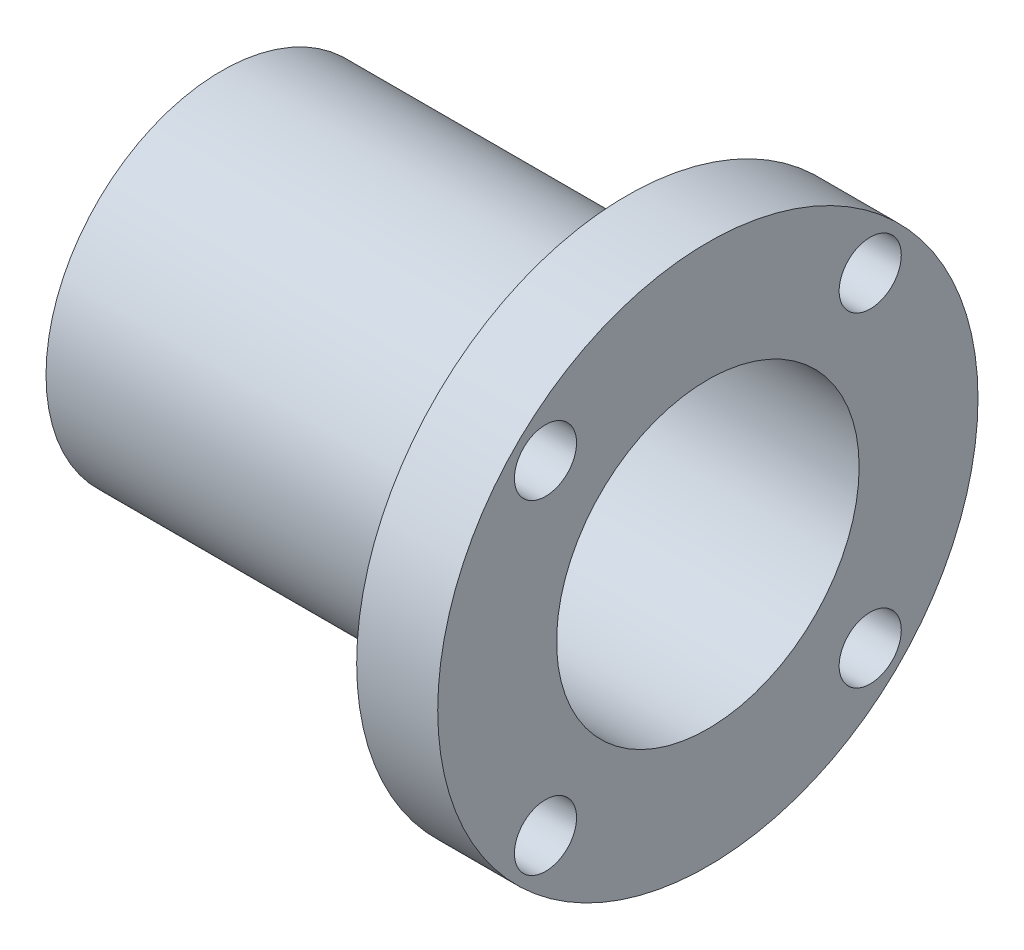
ISO-10303-21;
HEADER;
FILE_DESCRIPTION(('STEP AP214'),'2;1');
FILE_NAME('part.step','',(''),(''),'','','');
FILE_SCHEMA(('AUTOMOTIVE_DESIGN { 1 0 10303 214 1 1 1 1 }'));
ENDSEC;
DATA;
#1=APPLICATION_CONTEXT('core data for automotive mechanical design processes');
#2=APPLICATION_PROTOCOL_DEFINITION('international standard','automotive_design',2000,#1);
#3=PRODUCT_CONTEXT('',#1,'mechanical');
#4=PRODUCT('Part','Part','',(#3));
#5=PRODUCT_RELATED_PRODUCT_CATEGORY('part','',(#4));
#6=PRODUCT_DEFINITION_FORMATION('','',#4);
#7=PRODUCT_DEFINITION_CONTEXT('part definition',#1,'design');
#8=PRODUCT_DEFINITION('design','',#6,#7);
#9=PRODUCT_DEFINITION_SHAPE('','',#8);
#10=(LENGTH_UNIT() NAMED_UNIT(*) SI_UNIT(.MILLI.,.METRE.));
#11=(NAMED_UNIT(*) PLANE_ANGLE_UNIT() SI_UNIT($,.RADIAN.));
#12=(NAMED_UNIT(*) SI_UNIT($,.STERADIAN.) SOLID_ANGLE_UNIT());
#13=UNCERTAINTY_MEASURE_WITH_UNIT(LENGTH_MEASURE(1.E-05),#10,'distance_accuracy_value','');
#14=(GEOMETRIC_REPRESENTATION_CONTEXT(3) GLOBAL_UNCERTAINTY_ASSIGNED_CONTEXT((#13)) GLOBAL_UNIT_ASSIGNED_CONTEXT((#10,
#11,#12)) REPRESENTATION_CONTEXT('',''));
#15=CARTESIAN_POINT('',(0.,0.,0.));
#16=DIRECTION('',(0.,0.,1.));
#17=DIRECTION('',(1.,0.,0.));
#18=AXIS2_PLACEMENT_3D('',#15,#16,#17);
#19=CARTESIAN_POINT('',(3.,0.,0.));
#20=DIRECTION('',(-1.,0.,0.));
#21=DIRECTION('',(0.,0.,1.));
#22=AXIS2_PLACEMENT_3D('',#19,#20,#21);
#23=CYLINDRICAL_SURFACE('',#22,10.);
#24=CARTESIAN_POINT('',(3.,0.,0.));
#25=DIRECTION('',(1.,0.,0.));
#26=DIRECTION('',(0.,0.,-1.));
#27=AXIS2_PLACEMENT_3D('',#24,#25,#26);
#28=CIRCLE('',#27,10.);
#29=CARTESIAN_POINT('',(3.,0.,-10.));
#30=VERTEX_POINT('',#29);
#31=EDGE_CURVE('E10',#30,#30,#28,.T.);
#32=ORIENTED_EDGE('',*,*,#31,.F.);
#33=EDGE_LOOP('',(#32));
#34=FACE_BOUND('',#33,.T.);
#35=CARTESIAN_POINT('',(0.,0.,0.));
#36=DIRECTION('',(1.,0.,0.));
#37=DIRECTION('',(0.,0.,-1.));
#38=AXIS2_PLACEMENT_3D('',#35,#36,#37);
#39=CIRCLE('',#38,10.);
#40=CARTESIAN_POINT('',(0.,0.,-10.));
#41=VERTEX_POINT('',#40);
#42=EDGE_CURVE('E51',#41,#41,#39,.T.);
#43=ORIENTED_EDGE('',*,*,#42,.T.);
#44=EDGE_LOOP('',(#43));
#45=FACE_BOUND('',#44,.T.);
#46=ADVANCED_FACE('F43',(#34,#45),#23,.T.);
#47=CARTESIAN_POINT('',(3.,0.,0.));
#48=DIRECTION('',(1.,0.,0.));
#49=DIRECTION('',(0.,0.,-1.));
#50=AXIS2_PLACEMENT_3D('',#47,#48,#49);
#51=PLANE('',#50);
#52=CARTESIAN_POINT('',(3.,6.01040764008529,6.01040764008567));
#53=DIRECTION('',(1.,0.,0.));
#54=DIRECTION('',(0.,0.,-1.));
#55=AXIS2_PLACEMENT_3D('',#52,#53,#54);
#56=CIRCLE('',#55,1.15);
#57=CARTESIAN_POINT('',(3.,6.01040764008529,4.86040764008567));
#58=VERTEX_POINT('',#57);
#59=EDGE_CURVE('E87',#58,#58,#56,.T.);
#60=ORIENTED_EDGE('',*,*,#59,.F.);
#61=EDGE_LOOP('',(#60));
#62=FACE_BOUND('',#61,.T.);
#63=CARTESIAN_POINT('',(3.,-6.01040764008602,6.01040764008529));
#64=DIRECTION('',(1.,0.,0.));
#65=DIRECTION('',(0.,0.,-1.));
#66=AXIS2_PLACEMENT_3D('',#63,#64,#65);
#67=CIRCLE('',#66,1.15);
#68=CARTESIAN_POINT('',(3.,-6.01040764008602,4.8604076400853));
#69=VERTEX_POINT('',#68);
#70=EDGE_CURVE('E95',#69,#69,#67,.T.);
#71=ORIENTED_EDGE('',*,*,#70,.F.);
#72=EDGE_LOOP('',(#71));
#73=FACE_BOUND('',#72,.T.);
#74=CARTESIAN_POINT('',(3.,-6.01040764008564,-6.01040764008601));
#75=DIRECTION('',(1.,0.,0.));
#76=DIRECTION('',(0.,0.,-1.));
#77=AXIS2_PLACEMENT_3D('',#74,#75,#76);
#78=CIRCLE('',#77,1.15);
#79=CARTESIAN_POINT('',(3.,-6.01040764008564,-7.16040764008601));
#80=VERTEX_POINT('',#79);
#81=EDGE_CURVE('E103',#80,#80,#78,.T.);
#82=ORIENTED_EDGE('',*,*,#81,.F.);
#83=EDGE_LOOP('',(#82));
#84=FACE_BOUND('',#83,.T.);
#85=CARTESIAN_POINT('',(3.,6.01040764008567,-6.01040764008564));
#86=DIRECTION('',(1.,0.,0.));
#87=DIRECTION('',(0.,0.,-1.));
#88=AXIS2_PLACEMENT_3D('',#85,#86,#87);
#89=CIRCLE('',#88,1.15);
#90=CARTESIAN_POINT('',(3.,6.01040764008567,-7.16040764008564));
#91=VERTEX_POINT('',#90);
#92=EDGE_CURVE('E78',#91,#91,#89,.T.);
#93=ORIENTED_EDGE('',*,*,#92,.F.);
#94=EDGE_LOOP('',(#93));
#95=FACE_BOUND('',#94,.T.);
#96=CARTESIAN_POINT('',(3.,0.,0.));
#97=DIRECTION('',(1.,0.,0.));
#98=DIRECTION('',(0.,0.,-1.));
#99=AXIS2_PLACEMENT_3D('',#96,#97,#98);
#100=CIRCLE('',#99,5.6);
#101=CARTESIAN_POINT('',(3.,0.,-5.6));
#102=VERTEX_POINT('',#101);
#103=EDGE_CURVE('E71',#102,#102,#100,.T.);
#104=ORIENTED_EDGE('',*,*,#103,.F.);
#105=EDGE_LOOP('',(#104));
#106=FACE_BOUND('',#105,.T.);
#107=ORIENTED_EDGE('',*,*,#31,.T.);
#108=EDGE_LOOP('',(#107));
#109=FACE_BOUND('',#108,.T.);
#110=ADVANCED_FACE('F131',(#62,#73,#84,#95,#106,#109),#51,.T.);
#111=CARTESIAN_POINT('',(0.,0.,0.));
#112=DIRECTION('',(1.,0.,0.));
#113=DIRECTION('',(0.,0.,-1.));
#114=AXIS2_PLACEMENT_3D('',#111,#112,#113);
#115=PLANE('',#114);
#116=CARTESIAN_POINT('',(0.,6.01040764008529,6.01040764008567));
#117=DIRECTION('',(1.,0.,0.));
#118=DIRECTION('',(0.,0.,-1.));
#119=AXIS2_PLACEMENT_3D('',#116,#117,#118);
#120=CIRCLE('',#119,1.15);
#121=CARTESIAN_POINT('',(0.,6.01040764008529,4.86040764008567));
#122=VERTEX_POINT('',#121);
#123=EDGE_CURVE('E91',#122,#122,#120,.T.);
#124=ORIENTED_EDGE('',*,*,#123,.T.);
#125=EDGE_LOOP('',(#124));
#126=FACE_BOUND('',#125,.T.);
#127=CARTESIAN_POINT('',(0.,-6.01040764008602,6.01040764008529));
#128=DIRECTION('',(1.,0.,0.));
#129=DIRECTION('',(0.,0.,-1.));
#130=AXIS2_PLACEMENT_3D('',#127,#128,#129);
#131=CIRCLE('',#130,1.15);
#132=CARTESIAN_POINT('',(0.,-6.01040764008602,4.8604076400853));
#133=VERTEX_POINT('',#132);
#134=EDGE_CURVE('E99',#133,#133,#131,.T.);
#135=ORIENTED_EDGE('',*,*,#134,.T.);
#136=EDGE_LOOP('',(#135));
#137=FACE_BOUND('',#136,.T.);
#138=CARTESIAN_POINT('',(0.,-6.01040764008564,-6.01040764008601));
#139=DIRECTION('',(1.,0.,0.));
#140=DIRECTION('',(0.,0.,-1.));
#141=AXIS2_PLACEMENT_3D('',#138,#139,#140);
#142=CIRCLE('',#141,1.15);
#143=CARTESIAN_POINT('',(0.,-6.01040764008564,-7.16040764008601));
#144=VERTEX_POINT('',#143);
#145=EDGE_CURVE('E83',#144,#144,#142,.T.);
#146=ORIENTED_EDGE('',*,*,#145,.T.);
#147=EDGE_LOOP('',(#146));
#148=FACE_BOUND('',#147,.T.);
#149=CARTESIAN_POINT('',(0.,6.01040764008567,-6.01040764008564));
#150=DIRECTION('',(1.,0.,0.));
#151=DIRECTION('',(0.,0.,-1.));
#152=AXIS2_PLACEMENT_3D('',#149,#150,#151);
#153=CIRCLE('',#152,1.15);
#154=CARTESIAN_POINT('',(0.,6.01040764008567,-7.16040764008564));
#155=VERTEX_POINT('',#154);
#156=EDGE_CURVE('E79',#155,#155,#153,.T.);
#157=ORIENTED_EDGE('',*,*,#156,.T.);
#158=EDGE_LOOP('',(#157));
#159=FACE_BOUND('',#158,.T.);
#160=CARTESIAN_POINT('',(0.,0.,0.));
#161=DIRECTION('',(1.,0.,0.));
#162=DIRECTION('',(0.,0.,-1.));
#163=AXIS2_PLACEMENT_3D('',#160,#161,#162);
#164=CIRCLE('',#163,6.5);
#165=CARTESIAN_POINT('',(0.,0.,-6.5));
#166=VERTEX_POINT('',#165);
#167=EDGE_CURVE('E59',#166,#166,#164,.T.);
#168=ORIENTED_EDGE('',*,*,#167,.T.);
#169=EDGE_LOOP('',(#168));
#170=FACE_BOUND('',#169,.T.);
#171=ORIENTED_EDGE('',*,*,#42,.F.);
#172=EDGE_LOOP('',(#171));
#173=FACE_BOUND('',#172,.T.);
#174=ADVANCED_FACE('F111',(#126,#137,#148,#159,#170,#173),#115,.F.);
#175=CARTESIAN_POINT('',(-15.,0.,0.));
#176=DIRECTION('',(1.,0.,0.));
#177=DIRECTION('',(0.,0.,-1.));
#178=AXIS2_PLACEMENT_3D('',#175,#176,#177);
#179=CYLINDRICAL_SURFACE('',#178,6.5);
#180=ORIENTED_EDGE('',*,*,#167,.F.);
#181=EDGE_LOOP('',(#180));
#182=FACE_BOUND('',#181,.T.);
#183=CARTESIAN_POINT('',(-15.,0.,0.));
#184=DIRECTION('',(1.,0.,0.));
#185=DIRECTION('',(0.,0.,-1.));
#186=AXIS2_PLACEMENT_3D('',#183,#184,#185);
#187=CIRCLE('',#186,6.5);
#188=CARTESIAN_POINT('',(-15.,0.,-6.5));
#189=VERTEX_POINT('',#188);
#190=EDGE_CURVE('E57',#189,#189,#187,.T.);
#191=ORIENTED_EDGE('',*,*,#190,.T.);
#192=EDGE_LOOP('',(#191));
#193=FACE_BOUND('',#192,.T.);
#194=ADVANCED_FACE('F142',(#182,#193),#179,.T.);
#195=CARTESIAN_POINT('',(-15.,0.,0.));
#196=DIRECTION('',(1.,0.,0.));
#197=DIRECTION('',(0.,0.,-1.));
#198=AXIS2_PLACEMENT_3D('',#195,#196,#197);
#199=PLANE('',#198);
#200=ORIENTED_EDGE('',*,*,#190,.F.);
#201=EDGE_LOOP('',(#200));
#202=FACE_BOUND('',#201,.T.);
#203=CARTESIAN_POINT('',(-15.,0.,0.));
#204=DIRECTION('',(1.,0.,0.));
#205=DIRECTION('',(0.,0.,-1.));
#206=AXIS2_PLACEMENT_3D('',#203,#204,#205);
#207=CIRCLE('',#206,2.095);
#208=CARTESIAN_POINT('',(-15.,0.,-2.095));
#209=VERTEX_POINT('',#208);
#210=EDGE_CURVE('E66',#209,#209,#207,.T.);
#211=ORIENTED_EDGE('',*,*,#210,.T.);
#212=EDGE_LOOP('',(#211));
#213=FACE_BOUND('',#212,.T.);
#214=ADVANCED_FACE('F147',(#202,#213),#199,.F.);
#215=CARTESIAN_POINT('',(-12.,0.,0.));
#216=DIRECTION('',(1.,0.,0.));
#217=DIRECTION('',(0.,0.,-1.));
#218=AXIS2_PLACEMENT_3D('',#215,#216,#217);
#219=PLANE('',#218);
#220=CARTESIAN_POINT('',(-12.,0.,0.));
#221=DIRECTION('',(1.,0.,0.));
#222=DIRECTION('',(0.,0.,-1.));
#223=AXIS2_PLACEMENT_3D('',#220,#221,#222);
#224=CIRCLE('',#223,2.095);
#225=CARTESIAN_POINT('',(-12.,0.,-2.095));
#226=VERTEX_POINT('',#225);
#227=EDGE_CURVE('E70',#226,#226,#224,.T.);
#228=ORIENTED_EDGE('',*,*,#227,.F.);
#229=EDGE_LOOP('',(#228));
#230=FACE_BOUND('',#229,.T.);
#231=CARTESIAN_POINT('',(-12.,0.,0.));
#232=DIRECTION('',(1.,0.,0.));
#233=DIRECTION('',(0.,0.,-1.));
#234=AXIS2_PLACEMENT_3D('',#231,#232,#233);
#235=CIRCLE('',#234,5.6);
#236=CARTESIAN_POINT('',(-12.,0.,-5.6));
#237=VERTEX_POINT('',#236);
#238=EDGE_CURVE('E46',#237,#237,#235,.F.);
#239=ORIENTED_EDGE('',*,*,#238,.F.);
#240=EDGE_LOOP('',(#239));
#241=FACE_BOUND('',#240,.T.);
#242=ADVANCED_FACE('F154',(#230,#241),#219,.T.);
#243=CARTESIAN_POINT('',(-12.,0.,0.));
#244=DIRECTION('',(-1.,0.,0.));
#245=DIRECTION('',(0.,0.,1.));
#246=AXIS2_PLACEMENT_3D('',#243,#244,#245);
#247=CYLINDRICAL_SURFACE('',#246,2.095);
#248=ORIENTED_EDGE('',*,*,#227,.T.);
#249=EDGE_LOOP('',(#248));
#250=FACE_BOUND('',#249,.T.);
#251=ORIENTED_EDGE('',*,*,#210,.F.);
#252=EDGE_LOOP('',(#251));
#253=FACE_BOUND('',#252,.T.);
#254=ADVANCED_FACE('F158',(#250,#253),#247,.F.);
#255=CARTESIAN_POINT('',(-15.,0.,0.));
#256=DIRECTION('',(1.,0.,0.));
#257=DIRECTION('',(0.,0.,-1.));
#258=AXIS2_PLACEMENT_3D('',#255,#256,#257);
#259=CYLINDRICAL_SURFACE('',#258,5.6);
#260=ORIENTED_EDGE('',*,*,#238,.T.);
#261=EDGE_LOOP('',(#260));
#262=FACE_BOUND('',#261,.T.);
#263=ORIENTED_EDGE('',*,*,#103,.T.);
#264=EDGE_LOOP('',(#263));
#265=FACE_BOUND('',#264,.T.);
#266=ADVANCED_FACE('F127',(#262,#265),#259,.F.);
#267=CARTESIAN_POINT('',(3.,6.01040764008567,-6.01040764008564));
#268=DIRECTION('',(-1.,0.,0.));
#269=DIRECTION('',(0.,0.,1.));
#270=AXIS2_PLACEMENT_3D('',#267,#268,#269);
#271=CYLINDRICAL_SURFACE('',#270,1.15);
#272=ORIENTED_EDGE('',*,*,#92,.T.);
#273=EDGE_LOOP('',(#272));
#274=FACE_BOUND('',#273,.T.);
#275=ORIENTED_EDGE('',*,*,#156,.F.);
#276=EDGE_LOOP('',(#275));
#277=FACE_BOUND('',#276,.T.);
#278=ADVANCED_FACE('F117',(#274,#277),#271,.F.);
#279=CARTESIAN_POINT('',(3.,-6.01040764008564,-6.01040764008601));
#280=DIRECTION('',(-1.,0.,0.));
#281=DIRECTION('',(0.,0.,1.));
#282=AXIS2_PLACEMENT_3D('',#279,#280,#281);
#283=CYLINDRICAL_SURFACE('',#282,1.15);
#284=ORIENTED_EDGE('',*,*,#81,.T.);
#285=EDGE_LOOP('',(#284));
#286=FACE_BOUND('',#285,.T.);
#287=ORIENTED_EDGE('',*,*,#145,.F.);
#288=EDGE_LOOP('',(#287));
#289=FACE_BOUND('',#288,.T.);
#290=ADVANCED_FACE('F114',(#286,#289),#283,.F.);
#291=CARTESIAN_POINT('',(3.,-6.01040764008602,6.01040764008529));
#292=DIRECTION('',(-1.,0.,0.));
#293=DIRECTION('',(0.,0.,1.));
#294=AXIS2_PLACEMENT_3D('',#291,#292,#293);
#295=CYLINDRICAL_SURFACE('',#294,1.15);
#296=ORIENTED_EDGE('',*,*,#70,.T.);
#297=EDGE_LOOP('',(#296));
#298=FACE_BOUND('',#297,.T.);
#299=ORIENTED_EDGE('',*,*,#134,.F.);
#300=EDGE_LOOP('',(#299));
#301=FACE_BOUND('',#300,.T.);
#302=ADVANCED_FACE('F116',(#298,#301),#295,.F.);
#303=CARTESIAN_POINT('',(3.,6.01040764008529,6.01040764008567));
#304=DIRECTION('',(-1.,0.,0.));
#305=DIRECTION('',(0.,0.,1.));
#306=AXIS2_PLACEMENT_3D('',#303,#304,#305);
#307=CYLINDRICAL_SURFACE('',#306,1.15);
#308=ORIENTED_EDGE('',*,*,#59,.T.);
#309=EDGE_LOOP('',(#308));
#310=FACE_BOUND('',#309,.T.);
#311=ORIENTED_EDGE('',*,*,#123,.F.);
#312=EDGE_LOOP('',(#311));
#313=FACE_BOUND('',#312,.T.);
#314=ADVANCED_FACE('F124',(#310,#313),#307,.F.);
#315=CLOSED_SHELL('',(#46,#110,#174,#194,#214,#242,#254,#266,#278,#290,#302,#314));
#316=MANIFOLD_SOLID_BREP('B2',#315);
#317=ADVANCED_BREP_SHAPE_REPRESENTATION('',(#18,#316),#14);
#318=SHAPE_DEFINITION_REPRESENTATION(#9,#317);
ENDSEC;
END-ISO-10303-21;
